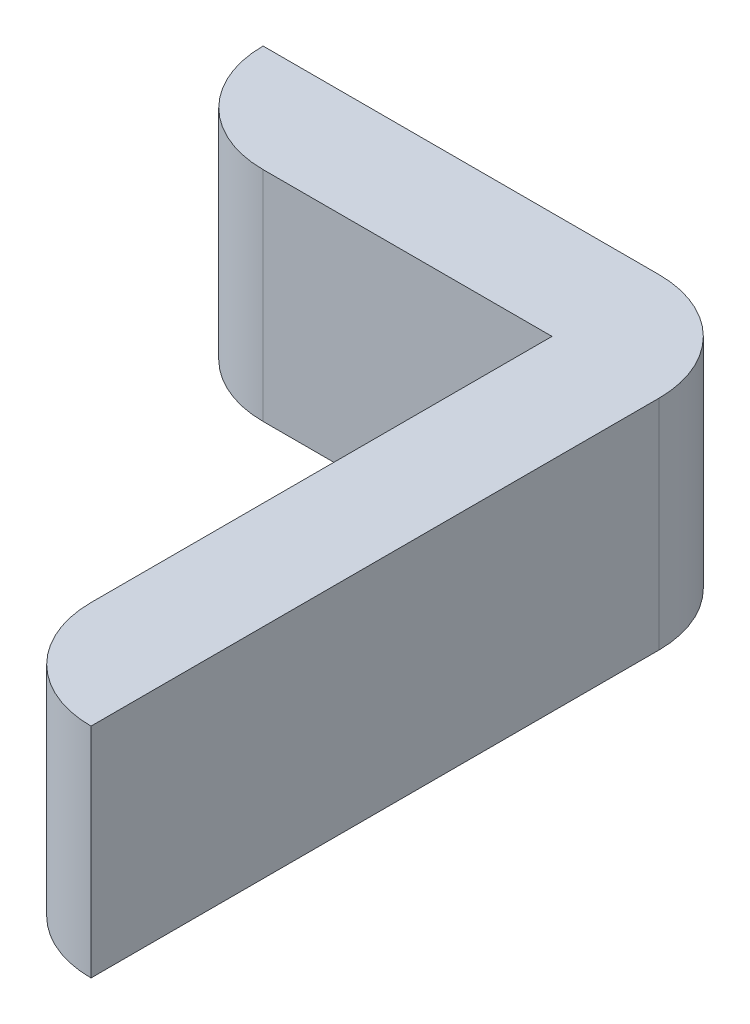
ISO-10303-21;
HEADER;
FILE_DESCRIPTION(('STEP AP214'),'2;1');
FILE_NAME('part.step','',(''),(''),'','','');
FILE_SCHEMA(('AUTOMOTIVE_DESIGN { 1 0 10303 214 1 1 1 1 }'));
ENDSEC;
DATA;
#1=APPLICATION_CONTEXT('core data for automotive mechanical design processes');
#2=APPLICATION_PROTOCOL_DEFINITION('international standard','automotive_design',2000,#1);
#3=PRODUCT_CONTEXT('',#1,'mechanical');
#4=PRODUCT('Part','Part','',(#3));
#5=PRODUCT_RELATED_PRODUCT_CATEGORY('part','',(#4));
#6=PRODUCT_DEFINITION_FORMATION('','',#4);
#7=PRODUCT_DEFINITION_CONTEXT('part definition',#1,'design');
#8=PRODUCT_DEFINITION('design','',#6,#7);
#9=PRODUCT_DEFINITION_SHAPE('','',#8);
#10=(LENGTH_UNIT() NAMED_UNIT(*) SI_UNIT(.MILLI.,.METRE.));
#11=(NAMED_UNIT(*) PLANE_ANGLE_UNIT() SI_UNIT($,.RADIAN.));
#12=(NAMED_UNIT(*) SI_UNIT($,.STERADIAN.) SOLID_ANGLE_UNIT());
#13=UNCERTAINTY_MEASURE_WITH_UNIT(LENGTH_MEASURE(1.E-05),#10,'distance_accuracy_value','');
#14=(GEOMETRIC_REPRESENTATION_CONTEXT(3) GLOBAL_UNCERTAINTY_ASSIGNED_CONTEXT((#13)) GLOBAL_UNIT_ASSIGNED_CONTEXT((#10,
#11,#12)) REPRESENTATION_CONTEXT('',''));
#15=CARTESIAN_POINT('',(0.,0.,0.));
#16=DIRECTION('',(0.,0.,1.));
#17=DIRECTION('',(1.,0.,0.));
#18=AXIS2_PLACEMENT_3D('',#15,#16,#17);
#19=CARTESIAN_POINT('',(-0.125,-8.6352,0.));
#20=DIRECTION('',(0.,-1.,0.));
#21=DIRECTION('',(0.,0.,-1.));
#22=AXIS2_PLACEMENT_3D('',#19,#20,#21);
#23=PLANE('',#22);
#24=DIRECTION('',(-1.,0.,0.));
#25=VECTOR('',#24,1.);
#26=CARTESIAN_POINT('',(0.125,-8.6352,0.25));
#27=LINE('',#26,#25);
#28=CARTESIAN_POINT('',(0.125,-8.6352,0.25));
#29=VERTEX_POINT('',#28);
#30=CARTESIAN_POINT('',(0.8,-8.6352,0.25));
#31=VERTEX_POINT('',#30);
#32=EDGE_CURVE('E102',#29,#31,#27,.F.);
#33=ORIENTED_EDGE('',*,*,#32,.T.);
#34=DIRECTION('',(0.,0.,-1.));
#35=VECTOR('',#34,1.);
#36=CARTESIAN_POINT('',(0.8,-8.6352,0.25));
#37=LINE('',#36,#35);
#38=CARTESIAN_POINT('',(0.8,-8.6352,1.327));
#39=VERTEX_POINT('',#38);
#40=EDGE_CURVE('E108',#31,#39,#37,.F.);
#41=ORIENTED_EDGE('',*,*,#40,.T.);
#42=CARTESIAN_POINT('',(1.05,-8.6352,1.327));
#43=DIRECTION('',(0.,-1.,0.));
#44=DIRECTION('',(0.,0.,-1.));
#45=AXIS2_PLACEMENT_3D('',#42,#43,#44);
#46=CIRCLE('',#45,0.25);
#47=CARTESIAN_POINT('',(1.05,-8.6352,1.577));
#48=VERTEX_POINT('',#47);
#49=EDGE_CURVE('E80',#48,#39,#46,.T.);
#50=ORIENTED_EDGE('',*,*,#49,.F.);
#51=DIRECTION('',(0.,0.,1.));
#52=VECTOR('',#51,1.);
#53=CARTESIAN_POINT('',(1.05,-8.6352,1.577));
#54=LINE('',#53,#52);
#55=CARTESIAN_POINT('',(1.05,-8.6352,0.25));
#56=VERTEX_POINT('',#55);
#57=EDGE_CURVE('E75',#48,#56,#54,.F.);
#58=ORIENTED_EDGE('',*,*,#57,.T.);
#59=CARTESIAN_POINT('',(0.8,-8.6352,0.25));
#60=DIRECTION('',(0.,-1.,0.));
#61=DIRECTION('',(0.,0.,-1.));
#62=AXIS2_PLACEMENT_3D('',#59,#60,#61);
#63=CIRCLE('',#62,0.25);
#64=CARTESIAN_POINT('',(0.8,-8.6352,0.));
#65=VERTEX_POINT('',#64);
#66=EDGE_CURVE('E19',#65,#56,#63,.T.);
#67=ORIENTED_EDGE('',*,*,#66,.F.);
#68=DIRECTION('',(1.,0.,0.));
#69=VECTOR('',#68,1.);
#70=CARTESIAN_POINT('',(0.8,-8.6352,0.));
#71=LINE('',#70,#69);
#72=CARTESIAN_POINT('',(-0.125,-8.6352,0.));
#73=VERTEX_POINT('',#72);
#74=EDGE_CURVE('E70',#65,#73,#71,.F.);
#75=ORIENTED_EDGE('',*,*,#74,.T.);
#76=CARTESIAN_POINT('',(0.125,-8.6352,0.));
#77=DIRECTION('',(0.,-1.,0.));
#78=DIRECTION('',(0.,0.,-1.));
#79=AXIS2_PLACEMENT_3D('',#76,#77,#78);
#80=CIRCLE('',#79,0.25);
#81=EDGE_CURVE('E121',#29,#73,#80,.T.);
#82=ORIENTED_EDGE('',*,*,#81,.F.);
#83=EDGE_LOOP('',(#33,#41,#50,#58,#67,#75,#82));
#84=FACE_BOUND('',#83,.T.);
#85=ADVANCED_FACE('F16',(#84),#23,.F.);
#86=CARTESIAN_POINT('',(0.8,-9.1448,0.));
#87=DIRECTION('',(0.,0.,1.));
#88=DIRECTION('',(1.,0.,0.));
#89=AXIS2_PLACEMENT_3D('',#86,#87,#88);
#90=PLANE('',#89);
#91=DIRECTION('',(0.,-1.,0.));
#92=VECTOR('',#91,1.);
#93=CARTESIAN_POINT('',(-0.125,-9.1448,0.));
#94=LINE('',#93,#92);
#95=CARTESIAN_POINT('',(-0.125,-9.1448,0.));
#96=VERTEX_POINT('',#95);
#97=EDGE_CURVE('E123',#73,#96,#94,.T.);
#98=ORIENTED_EDGE('',*,*,#97,.F.);
#99=ORIENTED_EDGE('',*,*,#74,.F.);
#100=DIRECTION('',(0.,-1.,0.));
#101=VECTOR('',#100,1.);
#102=CARTESIAN_POINT('',(0.8,-9.1448,0.));
#103=LINE('',#102,#101);
#104=CARTESIAN_POINT('',(0.8,-9.1448,0.));
#105=VERTEX_POINT('',#104);
#106=EDGE_CURVE('E92',#105,#65,#103,.F.);
#107=ORIENTED_EDGE('',*,*,#106,.F.);
#108=DIRECTION('',(1.,0.,0.));
#109=VECTOR('',#108,1.);
#110=CARTESIAN_POINT('',(-0.125,-9.1448,0.));
#111=LINE('',#110,#109);
#112=EDGE_CURVE('E120',#96,#105,#111,.T.);
#113=ORIENTED_EDGE('',*,*,#112,.F.);
#114=EDGE_LOOP('',(#98,#99,#107,#113));
#115=FACE_BOUND('',#114,.T.);
#116=ADVANCED_FACE('F158',(#115),#90,.F.);
#117=CARTESIAN_POINT('',(0.8,-9.1448,0.25));
#118=DIRECTION('',(0.,-1.,0.));
#119=DIRECTION('',(0.,0.,-1.));
#120=AXIS2_PLACEMENT_3D('',#117,#118,#119);
#121=CYLINDRICAL_SURFACE('',#120,0.25);
#122=ORIENTED_EDGE('',*,*,#66,.T.);
#123=DIRECTION('',(0.,1.,0.));
#124=VECTOR('',#123,1.);
#125=CARTESIAN_POINT('',(1.05,-9.1448,0.25));
#126=LINE('',#125,#124);
#127=CARTESIAN_POINT('',(1.05,-9.1448,0.25));
#128=VERTEX_POINT('',#127);
#129=EDGE_CURVE('E86',#56,#128,#126,.F.);
#130=ORIENTED_EDGE('',*,*,#129,.T.);
#131=CARTESIAN_POINT('',(0.8,-9.1448,0.25));
#132=DIRECTION('',(0.,-1.,0.));
#133=DIRECTION('',(0.,0.,-1.));
#134=AXIS2_PLACEMENT_3D('',#131,#132,#133);
#135=CIRCLE('',#134,0.25);
#136=EDGE_CURVE('E118',#105,#128,#135,.T.);
#137=ORIENTED_EDGE('',*,*,#136,.F.);
#138=ORIENTED_EDGE('',*,*,#106,.T.);
#139=EDGE_LOOP('',(#122,#130,#137,#138));
#140=FACE_BOUND('',#139,.T.);
#141=ADVANCED_FACE('F89',(#140),#121,.T.);
#142=CARTESIAN_POINT('',(1.05,-9.1448,1.577));
#143=DIRECTION('',(-1.,0.,0.));
#144=DIRECTION('',(0.,0.,1.));
#145=AXIS2_PLACEMENT_3D('',#142,#143,#144);
#146=PLANE('',#145);
#147=DIRECTION('',(0.,-1.,0.));
#148=VECTOR('',#147,1.);
#149=CARTESIAN_POINT('',(1.05,-9.1448,1.577));
#150=LINE('',#149,#148);
#151=CARTESIAN_POINT('',(1.05,-9.1448,1.577));
#152=VERTEX_POINT('',#151);
#153=EDGE_CURVE('E85',#152,#48,#150,.F.);
#154=ORIENTED_EDGE('',*,*,#153,.F.);
#155=DIRECTION('',(0.,0.,-1.));
#156=VECTOR('',#155,1.);
#157=CARTESIAN_POINT('',(1.05,-9.1448,0.));
#158=LINE('',#157,#156);
#159=EDGE_CURVE('E94',#128,#152,#158,.F.);
#160=ORIENTED_EDGE('',*,*,#159,.F.);
#161=ORIENTED_EDGE('',*,*,#129,.F.);
#162=ORIENTED_EDGE('',*,*,#57,.F.);
#163=EDGE_LOOP('',(#154,#160,#161,#162));
#164=FACE_BOUND('',#163,.T.);
#165=ADVANCED_FACE('F93',(#164),#146,.F.);
#166=CARTESIAN_POINT('',(1.05,-9.1448,1.327));
#167=DIRECTION('',(0.,-1.,0.));
#168=DIRECTION('',(0.,0.,-1.));
#169=AXIS2_PLACEMENT_3D('',#166,#167,#168);
#170=CYLINDRICAL_SURFACE('',#169,0.25);
#171=ORIENTED_EDGE('',*,*,#49,.T.);
#172=DIRECTION('',(0.,1.,0.));
#173=VECTOR('',#172,1.);
#174=CARTESIAN_POINT('',(0.8,-9.1448,1.327));
#175=LINE('',#174,#173);
#176=CARTESIAN_POINT('',(0.8,-9.1448,1.327));
#177=VERTEX_POINT('',#176);
#178=EDGE_CURVE('E105',#39,#177,#175,.F.);
#179=ORIENTED_EDGE('',*,*,#178,.T.);
#180=CARTESIAN_POINT('',(1.05,-9.1448,1.327));
#181=DIRECTION('',(0.,-1.,0.));
#182=DIRECTION('',(0.,0.,-1.));
#183=AXIS2_PLACEMENT_3D('',#180,#181,#182);
#184=CIRCLE('',#183,0.25);
#185=EDGE_CURVE('E114',#152,#177,#184,.T.);
#186=ORIENTED_EDGE('',*,*,#185,.F.);
#187=ORIENTED_EDGE('',*,*,#153,.T.);
#188=EDGE_LOOP('',(#171,#179,#186,#187));
#189=FACE_BOUND('',#188,.T.);
#190=ADVANCED_FACE('F127',(#189),#170,.T.);
#191=CARTESIAN_POINT('',(0.8,-9.1448,0.25));
#192=DIRECTION('',(1.,0.,0.));
#193=DIRECTION('',(0.,0.,-1.));
#194=AXIS2_PLACEMENT_3D('',#191,#192,#193);
#195=PLANE('',#194);
#196=ORIENTED_EDGE('',*,*,#178,.F.);
#197=ORIENTED_EDGE('',*,*,#40,.F.);
#198=DIRECTION('',(0.,1.,0.));
#199=VECTOR('',#198,1.);
#200=CARTESIAN_POINT('',(0.8,-9.1448,0.25));
#201=LINE('',#200,#199);
#202=CARTESIAN_POINT('',(0.8,-9.1448,0.25));
#203=VERTEX_POINT('',#202);
#204=EDGE_CURVE('E104',#31,#203,#201,.F.);
#205=ORIENTED_EDGE('',*,*,#204,.T.);
#206=DIRECTION('',(0.,0.,-1.));
#207=VECTOR('',#206,1.);
#208=CARTESIAN_POINT('',(0.8,-9.1448,0.));
#209=LINE('',#208,#207);
#210=EDGE_CURVE('E117',#177,#203,#209,.T.);
#211=ORIENTED_EDGE('',*,*,#210,.F.);
#212=EDGE_LOOP('',(#196,#197,#205,#211));
#213=FACE_BOUND('',#212,.T.);
#214=ADVANCED_FACE('F150',(#213),#195,.F.);
#215=CARTESIAN_POINT('',(0.125,-9.1448,0.25));
#216=DIRECTION('',(0.,0.,-1.));
#217=DIRECTION('',(-1.,0.,0.));
#218=AXIS2_PLACEMENT_3D('',#215,#216,#217);
#219=PLANE('',#218);
#220=ORIENTED_EDGE('',*,*,#204,.F.);
#221=ORIENTED_EDGE('',*,*,#32,.F.);
#222=DIRECTION('',(0.,-1.,0.));
#223=VECTOR('',#222,1.);
#224=CARTESIAN_POINT('',(0.125,-9.1448,0.25));
#225=LINE('',#224,#223);
#226=CARTESIAN_POINT('',(0.125,-9.1448,0.25));
#227=VERTEX_POINT('',#226);
#228=EDGE_CURVE('E34',#227,#29,#225,.F.);
#229=ORIENTED_EDGE('',*,*,#228,.F.);
#230=DIRECTION('',(1.,0.,0.));
#231=VECTOR('',#230,1.);
#232=CARTESIAN_POINT('',(-0.125,-9.1448,0.25));
#233=LINE('',#232,#231);
#234=EDGE_CURVE('E25',#203,#227,#233,.F.);
#235=ORIENTED_EDGE('',*,*,#234,.F.);
#236=EDGE_LOOP('',(#220,#221,#229,#235));
#237=FACE_BOUND('',#236,.T.);
#238=ADVANCED_FACE('F151',(#237),#219,.F.);
#239=CARTESIAN_POINT('',(0.125,-9.1448,0.));
#240=DIRECTION('',(0.,-1.,0.));
#241=DIRECTION('',(0.,0.,-1.));
#242=AXIS2_PLACEMENT_3D('',#239,#240,#241);
#243=CYLINDRICAL_SURFACE('',#242,0.25);
#244=ORIENTED_EDGE('',*,*,#81,.T.);
#245=ORIENTED_EDGE('',*,*,#97,.T.);
#246=CARTESIAN_POINT('',(0.125,-9.1448,0.));
#247=DIRECTION('',(0.,-1.,0.));
#248=DIRECTION('',(0.,0.,-1.));
#249=AXIS2_PLACEMENT_3D('',#246,#247,#248);
#250=CIRCLE('',#249,0.25);
#251=EDGE_CURVE('E11',#227,#96,#250,.T.);
#252=ORIENTED_EDGE('',*,*,#251,.F.);
#253=ORIENTED_EDGE('',*,*,#228,.T.);
#254=EDGE_LOOP('',(#244,#245,#252,#253));
#255=FACE_BOUND('',#254,.T.);
#256=ADVANCED_FACE('F156',(#255),#243,.T.);
#257=CARTESIAN_POINT('',(-0.125,-9.1448,0.));
#258=DIRECTION('',(0.,-1.,0.));
#259=DIRECTION('',(0.,0.,-1.));
#260=AXIS2_PLACEMENT_3D('',#257,#258,#259);
#261=PLANE('',#260);
#262=ORIENTED_EDGE('',*,*,#234,.T.);
#263=ORIENTED_EDGE('',*,*,#251,.T.);
#264=ORIENTED_EDGE('',*,*,#112,.T.);
#265=ORIENTED_EDGE('',*,*,#136,.T.);
#266=ORIENTED_EDGE('',*,*,#159,.T.);
#267=ORIENTED_EDGE('',*,*,#185,.T.);
#268=ORIENTED_EDGE('',*,*,#210,.T.);
#269=EDGE_LOOP('',(#262,#263,#264,#265,#266,#267,#268));
#270=FACE_BOUND('',#269,.T.);
#271=ADVANCED_FACE('F132',(#270),#261,.T.);
#272=CLOSED_SHELL('',(#85,#116,#141,#165,#190,#214,#238,#256,#271));
#273=MANIFOLD_SOLID_BREP('B1',#272);
#274=ADVANCED_BREP_SHAPE_REPRESENTATION('',(#18,#273),#14);
#275=SHAPE_DEFINITION_REPRESENTATION(#9,#274);
ENDSEC;
END-ISO-10303-21;
